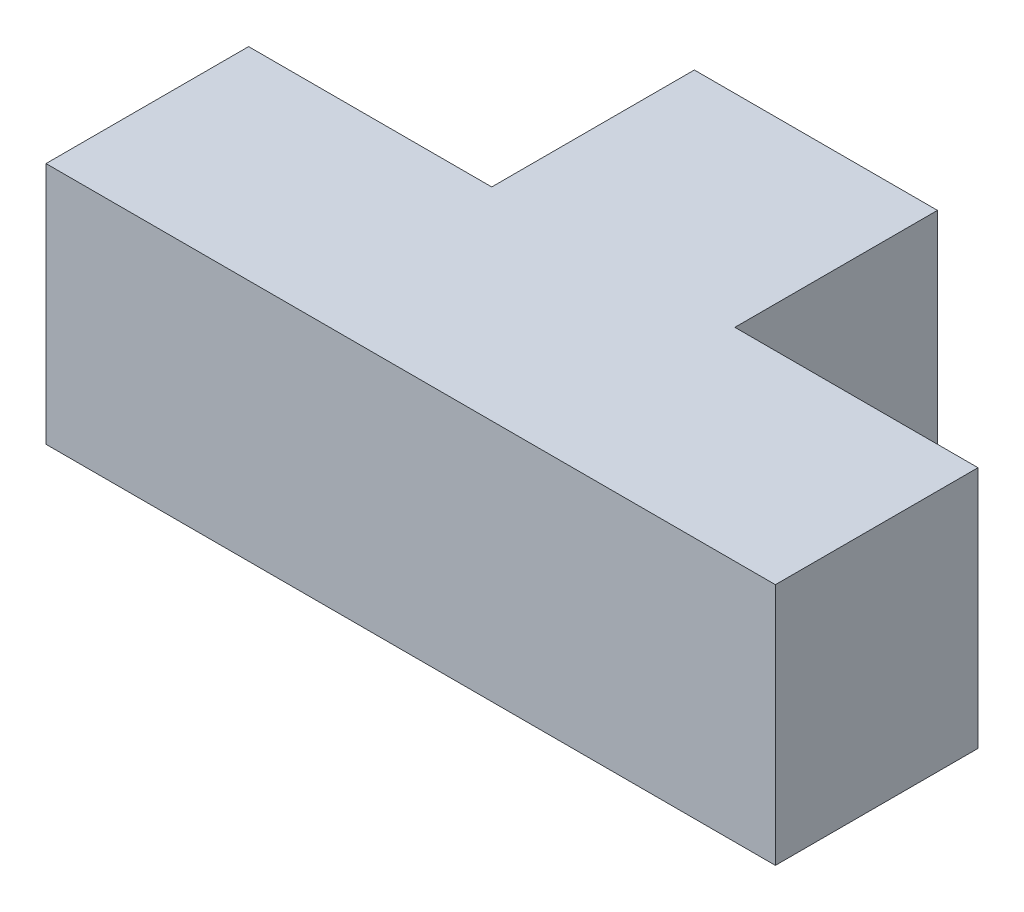
ISO-10303-21;
HEADER;
FILE_DESCRIPTION(('STEP AP214'),'2;1');
FILE_NAME('part.step','',(''),(''),'','','');
FILE_SCHEMA(('AUTOMOTIVE_DESIGN { 1 0 10303 214 1 1 1 1 }'));
ENDSEC;
DATA;
#1=APPLICATION_CONTEXT('core data for automotive mechanical design processes');
#2=APPLICATION_PROTOCOL_DEFINITION('international standard','automotive_design',2000,#1);
#3=PRODUCT_CONTEXT('',#1,'mechanical');
#4=PRODUCT('Part','Part','',(#3));
#5=PRODUCT_RELATED_PRODUCT_CATEGORY('part','',(#4));
#6=PRODUCT_DEFINITION_FORMATION('','',#4);
#7=PRODUCT_DEFINITION_CONTEXT('part definition',#1,'design');
#8=PRODUCT_DEFINITION('design','',#6,#7);
#9=PRODUCT_DEFINITION_SHAPE('','',#8);
#10=(LENGTH_UNIT() NAMED_UNIT(*) SI_UNIT(.MILLI.,.METRE.));
#11=(NAMED_UNIT(*) PLANE_ANGLE_UNIT() SI_UNIT($,.RADIAN.));
#12=(NAMED_UNIT(*) SI_UNIT($,.STERADIAN.) SOLID_ANGLE_UNIT());
#13=UNCERTAINTY_MEASURE_WITH_UNIT(LENGTH_MEASURE(1.E-05),#10,'distance_accuracy_value','');
#14=(GEOMETRIC_REPRESENTATION_CONTEXT(3) GLOBAL_UNCERTAINTY_ASSIGNED_CONTEXT((#13)) GLOBAL_UNIT_ASSIGNED_CONTEXT((#10,
#11,#12)) REPRESENTATION_CONTEXT('',''));
#15=CARTESIAN_POINT('',(0.,0.,0.));
#16=DIRECTION('',(0.,0.,1.));
#17=DIRECTION('',(1.,0.,0.));
#18=AXIS2_PLACEMENT_3D('',#15,#16,#17);
#19=CARTESIAN_POINT('',(30.,30.,-25.));
#20=DIRECTION('',(1.,0.,0.));
#21=DIRECTION('',(0.,0.,-1.));
#22=AXIS2_PLACEMENT_3D('',#19,#20,#21);
#23=PLANE('',#22);
#24=DIRECTION('',(0.,0.,1.));
#25=VECTOR('',#24,1.);
#26=CARTESIAN_POINT('',(30.,0.,-25.));
#27=LINE('',#26,#25);
#28=CARTESIAN_POINT('',(30.,0.,-50.));
#29=VERTEX_POINT('',#28);
#30=CARTESIAN_POINT('',(30.,0.,-25.));
#31=VERTEX_POINT('',#30);
#32=EDGE_CURVE('E129',#29,#31,#27,.T.);
#33=ORIENTED_EDGE('',*,*,#32,.T.);
#34=DIRECTION('',(0.,-1.,0.));
#35=VECTOR('',#34,1.);
#36=CARTESIAN_POINT('',(30.,30.,-25.));
#37=LINE('',#36,#35);
#38=CARTESIAN_POINT('',(30.,30.,-25.));
#39=VERTEX_POINT('',#38);
#40=EDGE_CURVE('E11',#39,#31,#37,.T.);
#41=ORIENTED_EDGE('',*,*,#40,.F.);
#42=DIRECTION('',(0.,0.,1.));
#43=VECTOR('',#42,1.);
#44=CARTESIAN_POINT('',(30.,30.,-25.));
#45=LINE('',#44,#43);
#46=CARTESIAN_POINT('',(30.,30.,-50.));
#47=VERTEX_POINT('',#46);
#48=EDGE_CURVE('E143',#47,#39,#45,.T.);
#49=ORIENTED_EDGE('',*,*,#48,.F.);
#50=DIRECTION('',(0.,-1.,0.));
#51=VECTOR('',#50,1.);
#52=CARTESIAN_POINT('',(30.,30.,-50.));
#53=LINE('',#52,#51);
#54=EDGE_CURVE('E125',#47,#29,#53,.T.);
#55=ORIENTED_EDGE('',*,*,#54,.T.);
#56=EDGE_LOOP('',(#33,#41,#49,#55));
#57=FACE_BOUND('',#56,.T.);
#58=ADVANCED_FACE('F33',(#57),#23,.F.);
#59=CARTESIAN_POINT('',(0.,30.,-25.));
#60=DIRECTION('',(0.,0.,1.));
#61=DIRECTION('',(1.,0.,0.));
#62=AXIS2_PLACEMENT_3D('',#59,#60,#61);
#63=PLANE('',#62);
#64=DIRECTION('',(-1.,0.,0.));
#65=VECTOR('',#64,1.);
#66=CARTESIAN_POINT('',(0.,0.,-25.));
#67=LINE('',#66,#65);
#68=CARTESIAN_POINT('',(0.,0.,-25.));
#69=VERTEX_POINT('',#68);
#70=EDGE_CURVE('E132',#31,#69,#67,.T.);
#71=ORIENTED_EDGE('',*,*,#70,.T.);
#72=DIRECTION('',(0.,-1.,0.));
#73=VECTOR('',#72,1.);
#74=CARTESIAN_POINT('',(0.,30.,-25.));
#75=LINE('',#74,#73);
#76=CARTESIAN_POINT('',(0.,30.,-25.));
#77=VERTEX_POINT('',#76);
#78=EDGE_CURVE('E41',#77,#69,#75,.T.);
#79=ORIENTED_EDGE('',*,*,#78,.F.);
#80=DIRECTION('',(-1.,0.,0.));
#81=VECTOR('',#80,1.);
#82=CARTESIAN_POINT('',(0.,30.,-25.));
#83=LINE('',#82,#81);
#84=EDGE_CURVE('E92',#39,#77,#83,.T.);
#85=ORIENTED_EDGE('',*,*,#84,.F.);
#86=ORIENTED_EDGE('',*,*,#40,.T.);
#87=EDGE_LOOP('',(#71,#79,#85,#86));
#88=FACE_BOUND('',#87,.T.);
#89=ADVANCED_FACE('F178',(#88),#63,.F.);
#90=CARTESIAN_POINT('',(0.,30.,0.));
#91=DIRECTION('',(1.,0.,0.));
#92=DIRECTION('',(0.,0.,-1.));
#93=AXIS2_PLACEMENT_3D('',#90,#91,#92);
#94=PLANE('',#93);
#95=DIRECTION('',(0.,0.,1.));
#96=VECTOR('',#95,1.);
#97=CARTESIAN_POINT('',(0.,0.,0.));
#98=LINE('',#97,#96);
#99=CARTESIAN_POINT('',(0.,0.,0.));
#100=VERTEX_POINT('',#99);
#101=EDGE_CURVE('E134',#69,#100,#98,.T.);
#102=ORIENTED_EDGE('',*,*,#101,.T.);
#103=DIRECTION('',(0.,-1.,0.));
#104=VECTOR('',#103,1.);
#105=CARTESIAN_POINT('',(0.,30.,0.));
#106=LINE('',#105,#104);
#107=CARTESIAN_POINT('',(0.,30.,0.));
#108=VERTEX_POINT('',#107);
#109=EDGE_CURVE('E150',#108,#100,#106,.T.);
#110=ORIENTED_EDGE('',*,*,#109,.F.);
#111=DIRECTION('',(0.,0.,1.));
#112=VECTOR('',#111,1.);
#113=CARTESIAN_POINT('',(0.,30.,0.));
#114=LINE('',#113,#112);
#115=EDGE_CURVE('E158',#77,#108,#114,.T.);
#116=ORIENTED_EDGE('',*,*,#115,.F.);
#117=ORIENTED_EDGE('',*,*,#78,.T.);
#118=EDGE_LOOP('',(#102,#110,#116,#117));
#119=FACE_BOUND('',#118,.T.);
#120=ADVANCED_FACE('F156',(#119),#94,.F.);
#121=CARTESIAN_POINT('',(90.,30.,0.));
#122=DIRECTION('',(0.,0.,-1.));
#123=DIRECTION('',(-1.,0.,0.));
#124=AXIS2_PLACEMENT_3D('',#121,#122,#123);
#125=PLANE('',#124);
#126=DIRECTION('',(1.,0.,0.));
#127=VECTOR('',#126,1.);
#128=CARTESIAN_POINT('',(90.,0.,0.));
#129=LINE('',#128,#127);
#130=CARTESIAN_POINT('',(90.,0.,0.));
#131=VERTEX_POINT('',#130);
#132=EDGE_CURVE('E136',#100,#131,#129,.T.);
#133=ORIENTED_EDGE('',*,*,#132,.T.);
#134=DIRECTION('',(0.,-1.,0.));
#135=VECTOR('',#134,1.);
#136=CARTESIAN_POINT('',(90.,30.,0.));
#137=LINE('',#136,#135);
#138=CARTESIAN_POINT('',(90.,30.,0.));
#139=VERTEX_POINT('',#138);
#140=EDGE_CURVE('E147',#139,#131,#137,.T.);
#141=ORIENTED_EDGE('',*,*,#140,.F.);
#142=DIRECTION('',(1.,0.,0.));
#143=VECTOR('',#142,1.);
#144=CARTESIAN_POINT('',(90.,30.,0.));
#145=LINE('',#144,#143);
#146=EDGE_CURVE('E170',#108,#139,#145,.T.);
#147=ORIENTED_EDGE('',*,*,#146,.F.);
#148=ORIENTED_EDGE('',*,*,#109,.T.);
#149=EDGE_LOOP('',(#133,#141,#147,#148));
#150=FACE_BOUND('',#149,.T.);
#151=ADVANCED_FACE('F166',(#150),#125,.F.);
#152=CARTESIAN_POINT('',(90.,30.,-25.));
#153=DIRECTION('',(-1.,0.,0.));
#154=DIRECTION('',(0.,0.,1.));
#155=AXIS2_PLACEMENT_3D('',#152,#153,#154);
#156=PLANE('',#155);
#157=DIRECTION('',(0.,0.,-1.));
#158=VECTOR('',#157,1.);
#159=CARTESIAN_POINT('',(90.,0.,-25.));
#160=LINE('',#159,#158);
#161=CARTESIAN_POINT('',(90.,0.,-25.));
#162=VERTEX_POINT('',#161);
#163=EDGE_CURVE('E138',#131,#162,#160,.T.);
#164=ORIENTED_EDGE('',*,*,#163,.T.);
#165=DIRECTION('',(0.,-1.,0.));
#166=VECTOR('',#165,1.);
#167=CARTESIAN_POINT('',(90.,30.,-25.));
#168=LINE('',#167,#166);
#169=CARTESIAN_POINT('',(90.,30.,-25.));
#170=VERTEX_POINT('',#169);
#171=EDGE_CURVE('E120',#170,#162,#168,.T.);
#172=ORIENTED_EDGE('',*,*,#171,.F.);
#173=DIRECTION('',(0.,0.,-1.));
#174=VECTOR('',#173,1.);
#175=CARTESIAN_POINT('',(90.,30.,-25.));
#176=LINE('',#175,#174);
#177=EDGE_CURVE('E111',#139,#170,#176,.T.);
#178=ORIENTED_EDGE('',*,*,#177,.F.);
#179=ORIENTED_EDGE('',*,*,#140,.T.);
#180=EDGE_LOOP('',(#164,#172,#178,#179));
#181=FACE_BOUND('',#180,.T.);
#182=ADVANCED_FACE('F169',(#181),#156,.F.);
#183=CARTESIAN_POINT('',(60.,30.,-25.));
#184=DIRECTION('',(0.,0.,1.));
#185=DIRECTION('',(1.,0.,0.));
#186=AXIS2_PLACEMENT_3D('',#183,#184,#185);
#187=PLANE('',#186);
#188=DIRECTION('',(-1.,0.,0.));
#189=VECTOR('',#188,1.);
#190=CARTESIAN_POINT('',(60.,0.,-25.));
#191=LINE('',#190,#189);
#192=CARTESIAN_POINT('',(60.,0.,-25.));
#193=VERTEX_POINT('',#192);
#194=EDGE_CURVE('E119',#162,#193,#191,.T.);
#195=ORIENTED_EDGE('',*,*,#194,.T.);
#196=DIRECTION('',(0.,-1.,0.));
#197=VECTOR('',#196,1.);
#198=CARTESIAN_POINT('',(60.,30.,-25.));
#199=LINE('',#198,#197);
#200=CARTESIAN_POINT('',(60.,30.,-25.));
#201=VERTEX_POINT('',#200);
#202=EDGE_CURVE('E116',#201,#193,#199,.T.);
#203=ORIENTED_EDGE('',*,*,#202,.F.);
#204=DIRECTION('',(-1.,0.,0.));
#205=VECTOR('',#204,1.);
#206=CARTESIAN_POINT('',(60.,30.,-25.));
#207=LINE('',#206,#205);
#208=EDGE_CURVE('E105',#170,#201,#207,.T.);
#209=ORIENTED_EDGE('',*,*,#208,.F.);
#210=ORIENTED_EDGE('',*,*,#171,.T.);
#211=EDGE_LOOP('',(#195,#203,#209,#210));
#212=FACE_BOUND('',#211,.T.);
#213=ADVANCED_FACE('F117',(#212),#187,.F.);
#214=CARTESIAN_POINT('',(60.,30.,-50.));
#215=DIRECTION('',(-1.,0.,0.));
#216=DIRECTION('',(0.,0.,1.));
#217=AXIS2_PLACEMENT_3D('',#214,#215,#216);
#218=PLANE('',#217);
#219=DIRECTION('',(0.,0.,-1.));
#220=VECTOR('',#219,1.);
#221=CARTESIAN_POINT('',(60.,0.,-50.));
#222=LINE('',#221,#220);
#223=CARTESIAN_POINT('',(60.,0.,-50.));
#224=VERTEX_POINT('',#223);
#225=EDGE_CURVE('E78',#193,#224,#222,.T.);
#226=ORIENTED_EDGE('',*,*,#225,.T.);
#227=DIRECTION('',(0.,-1.,0.));
#228=VECTOR('',#227,1.);
#229=CARTESIAN_POINT('',(60.,30.,-50.));
#230=LINE('',#229,#228);
#231=CARTESIAN_POINT('',(60.,30.,-50.));
#232=VERTEX_POINT('',#231);
#233=EDGE_CURVE('E121',#232,#224,#230,.T.);
#234=ORIENTED_EDGE('',*,*,#233,.F.);
#235=DIRECTION('',(0.,0.,-1.));
#236=VECTOR('',#235,1.);
#237=CARTESIAN_POINT('',(60.,30.,-50.));
#238=LINE('',#237,#236);
#239=EDGE_CURVE('E109',#201,#232,#238,.T.);
#240=ORIENTED_EDGE('',*,*,#239,.F.);
#241=ORIENTED_EDGE('',*,*,#202,.T.);
#242=EDGE_LOOP('',(#226,#234,#240,#241));
#243=FACE_BOUND('',#242,.T.);
#244=ADVANCED_FACE('F123',(#243),#218,.F.);
#245=CARTESIAN_POINT('',(30.,30.,-50.));
#246=DIRECTION('',(0.,0.,1.));
#247=DIRECTION('',(1.,0.,0.));
#248=AXIS2_PLACEMENT_3D('',#245,#246,#247);
#249=PLANE('',#248);
#250=DIRECTION('',(-1.,0.,0.));
#251=VECTOR('',#250,1.);
#252=CARTESIAN_POINT('',(30.,0.,-50.));
#253=LINE('',#252,#251);
#254=EDGE_CURVE('E84',#224,#29,#253,.T.);
#255=ORIENTED_EDGE('',*,*,#254,.T.);
#256=ORIENTED_EDGE('',*,*,#54,.F.);
#257=DIRECTION('',(-1.,0.,0.));
#258=VECTOR('',#257,1.);
#259=CARTESIAN_POINT('',(30.,30.,-50.));
#260=LINE('',#259,#258);
#261=EDGE_CURVE('E49',#232,#47,#260,.T.);
#262=ORIENTED_EDGE('',*,*,#261,.F.);
#263=ORIENTED_EDGE('',*,*,#233,.T.);
#264=EDGE_LOOP('',(#255,#256,#262,#263));
#265=FACE_BOUND('',#264,.T.);
#266=ADVANCED_FACE('F194',(#265),#249,.F.);
#267=CARTESIAN_POINT('',(0.,30.,0.));
#268=DIRECTION('',(0.,-1.,0.));
#269=DIRECTION('',(0.,0.,-1.));
#270=AXIS2_PLACEMENT_3D('',#267,#268,#269);
#271=PLANE('',#270);
#272=ORIENTED_EDGE('',*,*,#48,.T.);
#273=ORIENTED_EDGE('',*,*,#84,.T.);
#274=ORIENTED_EDGE('',*,*,#115,.T.);
#275=ORIENTED_EDGE('',*,*,#146,.T.);
#276=ORIENTED_EDGE('',*,*,#177,.T.);
#277=ORIENTED_EDGE('',*,*,#208,.T.);
#278=ORIENTED_EDGE('',*,*,#239,.T.);
#279=ORIENTED_EDGE('',*,*,#261,.T.);
#280=EDGE_LOOP('',(#272,#273,#274,#275,#276,#277,#278,#279));
#281=FACE_BOUND('',#280,.T.);
#282=ADVANCED_FACE('F107',(#281),#271,.F.);
#283=CARTESIAN_POINT('',(0.,0.,0.));
#284=DIRECTION('',(0.,-1.,0.));
#285=DIRECTION('',(0.,0.,-1.));
#286=AXIS2_PLACEMENT_3D('',#283,#284,#285);
#287=PLANE('',#286);
#288=ORIENTED_EDGE('',*,*,#32,.F.);
#289=ORIENTED_EDGE('',*,*,#254,.F.);
#290=ORIENTED_EDGE('',*,*,#225,.F.);
#291=ORIENTED_EDGE('',*,*,#194,.F.);
#292=ORIENTED_EDGE('',*,*,#163,.F.);
#293=ORIENTED_EDGE('',*,*,#132,.F.);
#294=ORIENTED_EDGE('',*,*,#101,.F.);
#295=ORIENTED_EDGE('',*,*,#70,.F.);
#296=EDGE_LOOP('',(#288,#289,#290,#291,#292,#293,#294,#295));
#297=FACE_BOUND('',#296,.T.);
#298=ADVANCED_FACE('F162',(#297),#287,.T.);
#299=CLOSED_SHELL('',(#58,#89,#120,#151,#182,#213,#244,#266,#282,#298));
#300=MANIFOLD_SOLID_BREP('B2',#299);
#301=ADVANCED_BREP_SHAPE_REPRESENTATION('',(#18,#300),#14);
#302=SHAPE_DEFINITION_REPRESENTATION(#9,#301);
ENDSEC;
END-ISO-10303-21;
